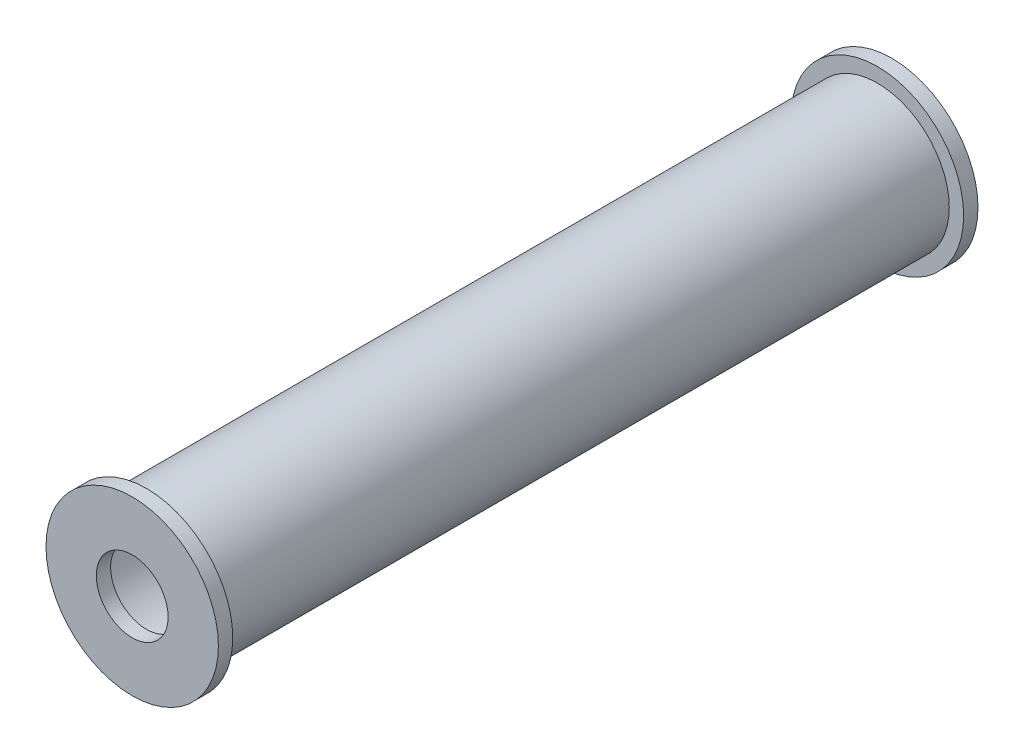
ISO-10303-21;
HEADER;
FILE_DESCRIPTION(('STEP AP214'),'2;1');
FILE_NAME('part.step','',(''),(''),'','','');
FILE_SCHEMA(('AUTOMOTIVE_DESIGN { 1 0 10303 214 1 1 1 1 }'));
ENDSEC;
DATA;
#1=APPLICATION_CONTEXT('core data for automotive mechanical design processes');
#2=APPLICATION_PROTOCOL_DEFINITION('international standard','automotive_design',2000,#1);
#3=PRODUCT_CONTEXT('',#1,'mechanical');
#4=PRODUCT('Part','Part','',(#3));
#5=PRODUCT_RELATED_PRODUCT_CATEGORY('part','',(#4));
#6=PRODUCT_DEFINITION_FORMATION('','',#4);
#7=PRODUCT_DEFINITION_CONTEXT('part definition',#1,'design');
#8=PRODUCT_DEFINITION('design','',#6,#7);
#9=PRODUCT_DEFINITION_SHAPE('','',#8);
#10=(LENGTH_UNIT() NAMED_UNIT(*) SI_UNIT(.MILLI.,.METRE.));
#11=(NAMED_UNIT(*) PLANE_ANGLE_UNIT() SI_UNIT($,.RADIAN.));
#12=(NAMED_UNIT(*) SI_UNIT($,.STERADIAN.) SOLID_ANGLE_UNIT());
#13=UNCERTAINTY_MEASURE_WITH_UNIT(LENGTH_MEASURE(1.E-05),#10,'distance_accuracy_value','');
#14=(GEOMETRIC_REPRESENTATION_CONTEXT(3) GLOBAL_UNCERTAINTY_ASSIGNED_CONTEXT((#13)) GLOBAL_UNIT_ASSIGNED_CONTEXT((#10,
#11,#12)) REPRESENTATION_CONTEXT('',''));
#15=CARTESIAN_POINT('',(0.,0.,0.));
#16=DIRECTION('',(0.,0.,1.));
#17=DIRECTION('',(1.,0.,0.));
#18=AXIS2_PLACEMENT_3D('',#15,#16,#17);
#19=CARTESIAN_POINT('',(0.,0.,50.87650029));
#20=DIRECTION('',(0.,0.,-1.));
#21=DIRECTION('',(-1.,0.,0.));
#22=AXIS2_PLACEMENT_3D('',#19,#20,#21);
#23=CYLINDRICAL_SURFACE('',#22,5.);
#24=CARTESIAN_POINT('',(0.,0.,50.87650029));
#25=DIRECTION('',(0.,0.,1.));
#26=DIRECTION('',(1.,0.,0.));
#27=AXIS2_PLACEMENT_3D('',#24,#25,#26);
#28=CIRCLE('',#27,5.);
#29=CARTESIAN_POINT('',(5.,0.,50.87650029));
#30=VERTEX_POINT('',#29);
#31=EDGE_CURVE('E10',#30,#30,#28,.T.);
#32=ORIENTED_EDGE('',*,*,#31,.F.);
#33=EDGE_LOOP('',(#32));
#34=FACE_BOUND('',#33,.T.);
#35=CARTESIAN_POINT('',(0.,0.,0.));
#36=DIRECTION('',(0.,0.,1.));
#37=DIRECTION('',(1.,0.,0.));
#38=AXIS2_PLACEMENT_3D('',#35,#36,#37);
#39=CIRCLE('',#38,5.);
#40=CARTESIAN_POINT('',(5.,0.,0.));
#41=VERTEX_POINT('',#40);
#42=EDGE_CURVE('E40',#41,#41,#39,.T.);
#43=ORIENTED_EDGE('',*,*,#42,.T.);
#44=EDGE_LOOP('',(#43));
#45=FACE_BOUND('',#44,.T.);
#46=ADVANCED_FACE('F37',(#34,#45),#23,.T.);
#47=CARTESIAN_POINT('',(0.,0.,50.87650029));
#48=DIRECTION('',(0.,0.,-1.));
#49=DIRECTION('',(-1.,0.,0.));
#50=AXIS2_PLACEMENT_3D('',#47,#48,#49);
#51=CYLINDRICAL_SURFACE('',#50,4.5);
#52=CARTESIAN_POINT('',(0.,0.,50.87650029));
#53=DIRECTION('',(0.,0.,1.));
#54=DIRECTION('',(1.,0.,0.));
#55=AXIS2_PLACEMENT_3D('',#52,#53,#54);
#56=CIRCLE('',#55,4.5);
#57=CARTESIAN_POINT('',(4.5,0.,50.87650029));
#58=VERTEX_POINT('',#57);
#59=EDGE_CURVE('E52',#58,#58,#56,.T.);
#60=ORIENTED_EDGE('',*,*,#59,.T.);
#61=EDGE_LOOP('',(#60));
#62=FACE_BOUND('',#61,.T.);
#63=CARTESIAN_POINT('',(0.,0.,0.));
#64=DIRECTION('',(0.,0.,1.));
#65=DIRECTION('',(1.,0.,0.));
#66=AXIS2_PLACEMENT_3D('',#63,#64,#65);
#67=CIRCLE('',#66,4.5);
#68=CARTESIAN_POINT('',(4.5,0.,0.));
#69=VERTEX_POINT('',#68);
#70=EDGE_CURVE('E45',#69,#69,#67,.T.);
#71=ORIENTED_EDGE('',*,*,#70,.F.);
#72=EDGE_LOOP('',(#71));
#73=FACE_BOUND('',#72,.T.);
#74=ADVANCED_FACE('F108',(#62,#73),#51,.F.);
#75=CARTESIAN_POINT('',(0.,0.,0.));
#76=DIRECTION('',(0.,0.,-1.));
#77=DIRECTION('',(-1.,0.,0.));
#78=AXIS2_PLACEMENT_3D('',#75,#76,#77);
#79=PLANE('',#78);
#80=CARTESIAN_POINT('',(0.,0.,0.));
#81=DIRECTION('',(0.,0.,-1.));
#82=DIRECTION('',(-1.,0.,0.));
#83=AXIS2_PLACEMENT_3D('',#80,#81,#82);
#84=CIRCLE('',#83,2.5);
#85=CARTESIAN_POINT('',(-2.5,0.,0.));
#86=VERTEX_POINT('',#85);
#87=EDGE_CURVE('E56',#86,#86,#84,.T.);
#88=ORIENTED_EDGE('',*,*,#87,.T.);
#89=EDGE_LOOP('',(#88));
#90=FACE_BOUND('',#89,.T.);
#91=ORIENTED_EDGE('',*,*,#70,.T.);
#92=EDGE_LOOP('',(#91));
#93=FACE_BOUND('',#92,.T.);
#94=ADVANCED_FACE('F113',(#90,#93),#79,.F.);
#95=CARTESIAN_POINT('',(0.,0.,-1.));
#96=DIRECTION('',(0.,0.,-1.));
#97=DIRECTION('',(-1.,0.,0.));
#98=AXIS2_PLACEMENT_3D('',#95,#96,#97);
#99=PLANE('',#98);
#100=CARTESIAN_POINT('',(0.,0.,-1.));
#101=DIRECTION('',(0.,0.,-1.));
#102=DIRECTION('',(-1.,0.,0.));
#103=AXIS2_PLACEMENT_3D('',#100,#101,#102);
#104=CIRCLE('',#103,6.);
#105=CARTESIAN_POINT('',(-6.,0.,-1.));
#106=VERTEX_POINT('',#105);
#107=EDGE_CURVE('E62',#106,#106,#104,.T.);
#108=ORIENTED_EDGE('',*,*,#107,.T.);
#109=EDGE_LOOP('',(#108));
#110=FACE_BOUND('',#109,.T.);
#111=CARTESIAN_POINT('',(0.,0.,-1.));
#112=DIRECTION('',(0.,0.,-1.));
#113=DIRECTION('',(-1.,0.,0.));
#114=AXIS2_PLACEMENT_3D('',#111,#112,#113);
#115=CIRCLE('',#114,2.5);
#116=CARTESIAN_POINT('',(-2.5,0.,-1.));
#117=VERTEX_POINT('',#116);
#118=EDGE_CURVE('E63',#117,#117,#115,.T.);
#119=ORIENTED_EDGE('',*,*,#118,.F.);
#120=EDGE_LOOP('',(#119));
#121=FACE_BOUND('',#120,.T.);
#122=ADVANCED_FACE('F124',(#110,#121),#99,.T.);
#123=ORIENTED_EDGE('',*,*,#42,.F.);
#124=EDGE_LOOP('',(#123));
#125=FACE_BOUND('',#124,.T.);
#126=CARTESIAN_POINT('',(0.,0.,0.));
#127=DIRECTION('',(0.,0.,-1.));
#128=DIRECTION('',(-1.,0.,0.));
#129=AXIS2_PLACEMENT_3D('',#126,#127,#128);
#130=CIRCLE('',#129,6.);
#131=CARTESIAN_POINT('',(-6.,0.,0.));
#132=VERTEX_POINT('',#131);
#133=EDGE_CURVE('E58',#132,#132,#130,.T.);
#134=ORIENTED_EDGE('',*,*,#133,.F.);
#135=EDGE_LOOP('',(#134));
#136=FACE_BOUND('',#135,.T.);
#137=ADVANCED_FACE('F120',(#125,#136),#79,.F.);
#138=CARTESIAN_POINT('',(0.,0.,-1.));
#139=DIRECTION('',(0.,0.,1.));
#140=DIRECTION('',(1.,0.,0.));
#141=AXIS2_PLACEMENT_3D('',#138,#139,#140);
#142=CYLINDRICAL_SURFACE('',#141,6.);
#143=ORIENTED_EDGE('',*,*,#107,.F.);
#144=EDGE_LOOP('',(#143));
#145=FACE_BOUND('',#144,.T.);
#146=ORIENTED_EDGE('',*,*,#133,.T.);
#147=EDGE_LOOP('',(#146));
#148=FACE_BOUND('',#147,.T.);
#149=ADVANCED_FACE('F123',(#145,#148),#142,.T.);
#150=CARTESIAN_POINT('',(0.,0.,-1.));
#151=DIRECTION('',(0.,0.,1.));
#152=DIRECTION('',(1.,0.,0.));
#153=AXIS2_PLACEMENT_3D('',#150,#151,#152);
#154=CYLINDRICAL_SURFACE('',#153,2.5);
#155=ORIENTED_EDGE('',*,*,#118,.T.);
#156=EDGE_LOOP('',(#155));
#157=FACE_BOUND('',#156,.T.);
#158=ORIENTED_EDGE('',*,*,#87,.F.);
#159=EDGE_LOOP('',(#158));
#160=FACE_BOUND('',#159,.T.);
#161=ADVANCED_FACE('F104',(#157,#160),#154,.F.);
#162=CARTESIAN_POINT('',(0.,0.,50.87650029));
#163=DIRECTION('',(0.,0.,1.));
#164=DIRECTION('',(1.,0.,0.));
#165=AXIS2_PLACEMENT_3D('',#162,#163,#164);
#166=PLANE('',#165);
#167=CARTESIAN_POINT('',(0.,0.,50.87650029));
#168=DIRECTION('',(0.,0.,1.));
#169=DIRECTION('',(1.,0.,0.));
#170=AXIS2_PLACEMENT_3D('',#167,#168,#169);
#171=CIRCLE('',#170,2.5);
#172=CARTESIAN_POINT('',(2.5,0.,50.87650029));
#173=VERTEX_POINT('',#172);
#174=EDGE_CURVE('E81',#173,#173,#171,.T.);
#175=ORIENTED_EDGE('',*,*,#174,.T.);
#176=EDGE_LOOP('',(#175));
#177=FACE_BOUND('',#176,.T.);
#178=ORIENTED_EDGE('',*,*,#59,.F.);
#179=EDGE_LOOP('',(#178));
#180=FACE_BOUND('',#179,.T.);
#181=ADVANCED_FACE('F95',(#177,#180),#166,.F.);
#182=CARTESIAN_POINT('',(0.,0.,51.87650029));
#183=DIRECTION('',(0.,0.,1.));
#184=DIRECTION('',(1.,0.,0.));
#185=AXIS2_PLACEMENT_3D('',#182,#183,#184);
#186=PLANE('',#185);
#187=CARTESIAN_POINT('',(0.,0.,51.87650029));
#188=DIRECTION('',(0.,0.,1.));
#189=DIRECTION('',(1.,0.,0.));
#190=AXIS2_PLACEMENT_3D('',#187,#188,#189);
#191=CIRCLE('',#190,6.);
#192=CARTESIAN_POINT('',(6.,0.,51.87650029));
#193=VERTEX_POINT('',#192);
#194=EDGE_CURVE('E57',#193,#193,#191,.T.);
#195=ORIENTED_EDGE('',*,*,#194,.T.);
#196=EDGE_LOOP('',(#195));
#197=FACE_BOUND('',#196,.T.);
#198=CARTESIAN_POINT('',(0.,0.,51.87650029));
#199=DIRECTION('',(0.,0.,1.));
#200=DIRECTION('',(1.,0.,0.));
#201=AXIS2_PLACEMENT_3D('',#198,#199,#200);
#202=CIRCLE('',#201,2.5);
#203=CARTESIAN_POINT('',(2.5,0.,51.87650029));
#204=VERTEX_POINT('',#203);
#205=EDGE_CURVE('E77',#204,#204,#202,.T.);
#206=ORIENTED_EDGE('',*,*,#205,.F.);
#207=EDGE_LOOP('',(#206));
#208=FACE_BOUND('',#207,.T.);
#209=ADVANCED_FACE('F92',(#197,#208),#186,.T.);
#210=ORIENTED_EDGE('',*,*,#31,.T.);
#211=EDGE_LOOP('',(#210));
#212=FACE_BOUND('',#211,.T.);
#213=CARTESIAN_POINT('',(0.,0.,50.87650029));
#214=DIRECTION('',(0.,0.,1.));
#215=DIRECTION('',(1.,0.,0.));
#216=AXIS2_PLACEMENT_3D('',#213,#214,#215);
#217=CIRCLE('',#216,6.);
#218=CARTESIAN_POINT('',(6.,0.,50.87650029));
#219=VERTEX_POINT('',#218);
#220=EDGE_CURVE('E73',#219,#219,#217,.T.);
#221=ORIENTED_EDGE('',*,*,#220,.F.);
#222=EDGE_LOOP('',(#221));
#223=FACE_BOUND('',#222,.T.);
#224=ADVANCED_FACE('F94',(#212,#223),#166,.F.);
#225=CARTESIAN_POINT('',(0.,0.,51.87650029));
#226=DIRECTION('',(0.,0.,-1.));
#227=DIRECTION('',(-1.,0.,0.));
#228=AXIS2_PLACEMENT_3D('',#225,#226,#227);
#229=CYLINDRICAL_SURFACE('',#228,6.);
#230=ORIENTED_EDGE('',*,*,#194,.F.);
#231=EDGE_LOOP('',(#230));
#232=FACE_BOUND('',#231,.T.);
#233=ORIENTED_EDGE('',*,*,#220,.T.);
#234=EDGE_LOOP('',(#233));
#235=FACE_BOUND('',#234,.T.);
#236=ADVANCED_FACE('F102',(#232,#235),#229,.T.);
#237=CARTESIAN_POINT('',(0.,0.,51.87650029));
#238=DIRECTION('',(0.,0.,-1.));
#239=DIRECTION('',(-1.,0.,0.));
#240=AXIS2_PLACEMENT_3D('',#237,#238,#239);
#241=CYLINDRICAL_SURFACE('',#240,2.5);
#242=ORIENTED_EDGE('',*,*,#205,.T.);
#243=EDGE_LOOP('',(#242));
#244=FACE_BOUND('',#243,.T.);
#245=ORIENTED_EDGE('',*,*,#174,.F.);
#246=EDGE_LOOP('',(#245));
#247=FACE_BOUND('',#246,.T.);
#248=ADVANCED_FACE('F89',(#244,#247),#241,.F.);
#249=CLOSED_SHELL('',(#46,#74,#94,#122,#137,#149,#161,#181,#209,#224,#236,#248));
#250=MANIFOLD_SOLID_BREP('B2',#249);
#251=ADVANCED_BREP_SHAPE_REPRESENTATION('',(#18,#250),#14);
#252=SHAPE_DEFINITION_REPRESENTATION(#9,#251);
ENDSEC;
END-ISO-10303-21;
